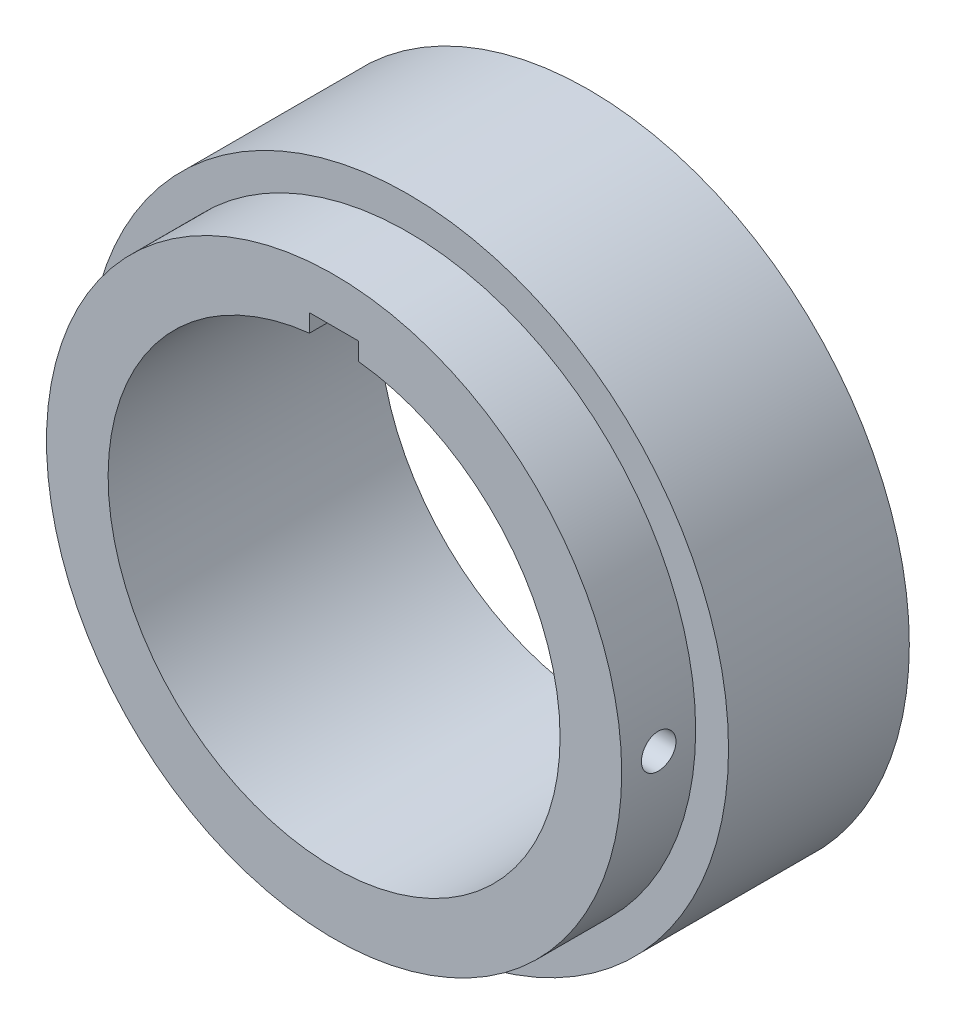
ISO-10303-21;
HEADER;
FILE_DESCRIPTION(('STEP AP214'),'2;1');
FILE_NAME('part.step','',(''),(''),'','','');
FILE_SCHEMA(('AUTOMOTIVE_DESIGN { 1 0 10303 214 1 1 1 1 }'));
ENDSEC;
DATA;
#1=APPLICATION_CONTEXT('core data for automotive mechanical design processes');
#2=APPLICATION_PROTOCOL_DEFINITION('international standard','automotive_design',2000,#1);
#3=PRODUCT_CONTEXT('',#1,'mechanical');
#4=PRODUCT('Part','Part','',(#3));
#5=PRODUCT_RELATED_PRODUCT_CATEGORY('part','',(#4));
#6=PRODUCT_DEFINITION_FORMATION('','',#4);
#7=PRODUCT_DEFINITION_CONTEXT('part definition',#1,'design');
#8=PRODUCT_DEFINITION('design','',#6,#7);
#9=PRODUCT_DEFINITION_SHAPE('','',#8);
#10=(LENGTH_UNIT() NAMED_UNIT(*) SI_UNIT(.MILLI.,.METRE.));
#11=(NAMED_UNIT(*) PLANE_ANGLE_UNIT() SI_UNIT($,.RADIAN.));
#12=(NAMED_UNIT(*) SI_UNIT($,.STERADIAN.) SOLID_ANGLE_UNIT());
#13=UNCERTAINTY_MEASURE_WITH_UNIT(LENGTH_MEASURE(1.E-05),#10,'distance_accuracy_value','');
#14=(GEOMETRIC_REPRESENTATION_CONTEXT(3) GLOBAL_UNCERTAINTY_ASSIGNED_CONTEXT((#13)) GLOBAL_UNIT_ASSIGNED_CONTEXT((#10,
#11,#12)) REPRESENTATION_CONTEXT('',''));
#15=CARTESIAN_POINT('',(0.,0.,0.));
#16=DIRECTION('',(0.,0.,1.));
#17=DIRECTION('',(1.,0.,0.));
#18=AXIS2_PLACEMENT_3D('',#15,#16,#17);
#19=CARTESIAN_POINT('',(0.,0.,0.));
#20=DIRECTION('',(0.,0.,1.));
#21=DIRECTION('',(1.,0.,0.));
#22=AXIS2_PLACEMENT_3D('',#19,#20,#21);
#23=PLANE('',#22);
#24=CARTESIAN_POINT('',(0.,0.,0.));
#25=DIRECTION('',(0.,0.,1.));
#26=DIRECTION('',(1.,0.,0.));
#27=AXIS2_PLACEMENT_3D('',#24,#25,#26);
#28=CIRCLE('',#27,39.);
#29=CARTESIAN_POINT('',(39.,0.,0.));
#30=VERTEX_POINT('',#29);
#31=EDGE_CURVE('E115',#30,#30,#28,.T.);
#32=ORIENTED_EDGE('',*,*,#31,.F.);
#33=EDGE_LOOP('',(#32));
#34=FACE_BOUND('',#33,.T.);
#35=CARTESIAN_POINT('',(0.,0.,0.));
#36=DIRECTION('',(0.,0.,1.));
#37=DIRECTION('',(1.,0.,0.));
#38=AXIS2_PLACEMENT_3D('',#35,#36,#37);
#39=CIRCLE('',#38,37.5);
#40=CARTESIAN_POINT('',(37.5,0.,0.));
#41=VERTEX_POINT('',#40);
#42=EDGE_CURVE('E121',#41,#41,#39,.F.);
#43=ORIENTED_EDGE('',*,*,#42,.F.);
#44=EDGE_LOOP('',(#43));
#45=FACE_BOUND('',#44,.T.);
#46=ADVANCED_FACE('F38',(#34,#45),#23,.F.);
#47=CARTESIAN_POINT('',(0.,0.,22.));
#48=DIRECTION('',(0.,0.,1.));
#49=DIRECTION('',(1.,0.,0.));
#50=AXIS2_PLACEMENT_3D('',#47,#48,#49);
#51=PLANE('',#50);
#52=CARTESIAN_POINT('',(0.,0.,22.));
#53=DIRECTION('',(0.,0.,1.));
#54=DIRECTION('',(1.,0.,0.));
#55=AXIS2_PLACEMENT_3D('',#52,#53,#54);
#56=CIRCLE('',#55,39.);
#57=CARTESIAN_POINT('',(39.,0.,22.));
#58=VERTEX_POINT('',#57);
#59=EDGE_CURVE('E118',#58,#58,#56,.T.);
#60=ORIENTED_EDGE('',*,*,#59,.T.);
#61=EDGE_LOOP('',(#60));
#62=FACE_BOUND('',#61,.T.);
#63=CARTESIAN_POINT('',(0.,0.,22.));
#64=DIRECTION('',(0.,0.,1.));
#65=DIRECTION('',(1.,0.,0.));
#66=AXIS2_PLACEMENT_3D('',#63,#64,#65);
#67=CIRCLE('',#66,35.);
#68=CARTESIAN_POINT('',(35.,0.,22.));
#69=VERTEX_POINT('',#68);
#70=EDGE_CURVE('E109',#69,#69,#67,.T.);
#71=ORIENTED_EDGE('',*,*,#70,.F.);
#72=EDGE_LOOP('',(#71));
#73=FACE_BOUND('',#72,.T.);
#74=ADVANCED_FACE('F149',(#62,#73),#51,.T.);
#75=CARTESIAN_POINT('',(0.,0.,22.));
#76=DIRECTION('',(0.,0.,-1.));
#77=DIRECTION('',(-1.,0.,0.));
#78=AXIS2_PLACEMENT_3D('',#75,#76,#77);
#79=CYLINDRICAL_SURFACE('',#78,39.);
#80=ORIENTED_EDGE('',*,*,#59,.F.);
#81=EDGE_LOOP('',(#80));
#82=FACE_BOUND('',#81,.T.);
#83=ORIENTED_EDGE('',*,*,#31,.T.);
#84=EDGE_LOOP('',(#83));
#85=FACE_BOUND('',#84,.T.);
#86=ADVANCED_FACE('F155',(#82,#85),#79,.T.);
#87=CARTESIAN_POINT('',(0.,0.,31.));
#88=DIRECTION('',(0.,0.,-1.));
#89=DIRECTION('',(-1.,0.,0.));
#90=AXIS2_PLACEMENT_3D('',#87,#88,#89);
#91=CYLINDRICAL_SURFACE('',#90,35.);
#92=CARTESIAN_POINT('',(35.,0.,24.4));
#93=CARTESIAN_POINT('',(34.9999991613155,-0.117844175806978,24.4000051886548));
#94=CARTESIAN_POINT('',(34.9993984651507,-0.235771095805588,24.4099527927887));
#95=CARTESIAN_POINT('',(34.9970599188172,-0.468369368929395,24.4494933481978));
#96=CARTESIAN_POINT('',(34.9953207415902,-0.583036759662994,24.4791092261704));
#97=CARTESIAN_POINT('',(34.990902002106,-0.80571306343822,24.5571332208374));
#98=CARTESIAN_POINT('',(34.9882229323209,-0.913725428713387,24.6055314975936));
#99=CARTESIAN_POINT('',(34.9822258167798,-1.12006459060454,24.7197306672778));
#100=CARTESIAN_POINT('',(34.9789079183873,-1.21839361306148,24.7855275480381));
#101=CARTESIAN_POINT('',(34.9720009937799,-1.40274018967803,24.9327568020215));
#102=CARTESIAN_POINT('',(34.9684116403171,-1.48874251019537,25.0142082355815));
#103=CARTESIAN_POINT('',(34.961369145851,-1.64586419821276,25.1903954090425));
#104=CARTESIAN_POINT('',(34.9579160105162,-1.71698294688472,25.285131701027));
#105=CARTESIAN_POINT('',(34.9515328754156,-1.84236481498864,25.485284589567));
#106=CARTESIAN_POINT('',(34.9486032652102,-1.8966154046809,25.5907090486257));
#107=CARTESIAN_POINT('',(34.9436017471188,-1.98664077162483,25.8091904954062));
#108=CARTESIAN_POINT('',(34.9415298306016,-2.02241573480395,25.9222474063068));
#109=CARTESIAN_POINT('',(34.9384804405188,-2.07443238191165,26.1526388011088));
#110=CARTESIAN_POINT('',(34.9375016397014,-2.09069775599912,26.269967918512));
#111=CARTESIAN_POINT('',(34.9367448835944,-2.103306634241,26.505694891857));
#112=CARTESIAN_POINT('',(34.9369669156032,-2.09965034911297,26.6240927364813));
#113=CARTESIAN_POINT('',(34.9385855541585,-2.07253937054003,26.8584349476114));
#114=CARTESIAN_POINT('',(34.9399806403301,-2.04911030410293,26.9743822908574));
#115=CARTESIAN_POINT('',(34.9437857703825,-1.98315856996509,27.2006954628356));
#116=CARTESIAN_POINT('',(34.9461958199554,-1.94063579518459,27.311061260262));
#117=CARTESIAN_POINT('',(34.951761022144,-1.83767457902033,27.523160842485));
#118=CARTESIAN_POINT('',(34.9549166585015,-1.77722449975263,27.624888964603));
#119=CARTESIAN_POINT('',(34.9616169171288,-1.64013307309805,27.816763594482));
#120=CARTESIAN_POINT('',(34.9651615434173,-1.56349155842882,27.9069099825703));
#121=CARTESIAN_POINT('',(34.9722470659153,-1.39604843547954,28.0732113335103));
#122=CARTESIAN_POINT('',(34.9757879473825,-1.30522464568503,28.1493439649768));
#123=CARTESIAN_POINT('',(34.9824615478539,-1.11207292990968,28.2852844619456));
#124=CARTESIAN_POINT('',(34.9855942667255,-1.00974500019593,28.3450923221507));
#125=CARTESIAN_POINT('',(34.9910987437918,-0.796476279334773,28.4466836060103));
#126=CARTESIAN_POINT('',(34.9934704668885,-0.685535091226617,28.4884661983484));
#127=CARTESIAN_POINT('',(34.9971852047097,-0.458195061217815,28.5528060442005));
#128=CARTESIAN_POINT('',(34.9985282305084,-0.341796278084261,28.5753635046795));
#129=CARTESIAN_POINT('',(35.0000328044319,-0.10703897136977,28.6005851243473));
#130=CARTESIAN_POINT('',(35.0001961864197,0.0113162235317343,28.6032801616056));
#131=CARTESIAN_POINT('',(34.9993279372793,0.246797037935939,28.58878109084));
#132=CARTESIAN_POINT('',(34.9982963118754,0.363922663325893,28.5715870780899));
#133=CARTESIAN_POINT('',(34.9951553764755,0.59353268605767,28.5178235470478));
#134=CARTESIAN_POINT('',(34.9930468536715,0.706020408800857,28.4812681808272));
#135=CARTESIAN_POINT('',(34.9879893773591,0.923264107325084,28.3898339833525));
#136=CARTESIAN_POINT('',(34.9850404168806,1.02802001897363,28.3349550001318));
#137=CARTESIAN_POINT('',(34.9786289361573,1.22696794347034,28.2083526791793));
#138=CARTESIAN_POINT('',(34.9751657885825,1.32114680182054,28.1366087021856));
#139=CARTESIAN_POINT('',(34.9681178358473,1.49613483866214,27.9783430082272));
#140=CARTESIAN_POINT('',(34.9645330295804,1.57694389553163,27.8918211568462));
#141=CARTESIAN_POINT('',(34.9576404999568,1.72300291551882,27.706322616381));
#142=CARTESIAN_POINT('',(34.9543331366402,1.78823285809712,27.6073301481992));
#143=CARTESIAN_POINT('',(34.948374181286,1.90114508952379,27.399779803849));
#144=CARTESIAN_POINT('',(34.945722585462,1.94882747969125,27.2912219829152));
#145=CARTESIAN_POINT('',(34.9413767794724,2.02525635717478,27.0676958453405));
#146=CARTESIAN_POINT('',(34.939681930539,2.05401548065653,26.952731862221));
#147=CARTESIAN_POINT('',(34.9374389708401,2.09182274062151,26.7195965121583));
#148=CARTESIAN_POINT('',(34.936890849757,2.10087105445275,26.6014251740829));
#149=CARTESIAN_POINT('',(34.9370034072185,2.09899815383948,26.3654286752178));
#150=CARTESIAN_POINT('',(34.9376621802684,2.08810841843393,26.247603262403));
#151=CARTESIAN_POINT('',(34.9401102524472,2.04673376244267,26.0154570255148));
#152=CARTESIAN_POINT('',(34.9418995536499,2.01624880591094,25.9011362078707));
#153=CARTESIAN_POINT('',(34.9464065781605,1.93655602438641,25.6792392031706));
#154=CARTESIAN_POINT('',(34.949124298203,1.88734826524505,25.5716629923941));
#155=CARTESIAN_POINT('',(34.9551818318302,1.77161121831211,25.366295422745));
#156=CARTESIAN_POINT('',(34.9585216286548,1.70508239717215,25.2685038003613));
#157=CARTESIAN_POINT('',(34.9654530674257,1.5564759218203,25.0853221004038));
#158=CARTESIAN_POINT('',(34.9690450710395,1.47437563882212,24.9999503948044));
#159=CARTESIAN_POINT('',(34.9760731406369,1.29698473951482,24.8441722861038));
#160=CARTESIAN_POINT('',(34.9795091682073,1.20169089709504,24.7737695539495));
#161=CARTESIAN_POINT('',(34.9858414075535,1.00051681538948,24.6498801801636));
#162=CARTESIAN_POINT('',(34.9887369797973,0.89462425910766,24.596413527872));
#163=CARTESIAN_POINT('',(34.9936532649078,0.6754253444206,24.5080833856066));
#164=CARTESIAN_POINT('',(34.9956750037597,0.562127861290517,24.4731980676695));
#165=CARTESIAN_POINT('',(34.9980849369697,0.373445723595397,24.4321060190323));
#166=CARTESIAN_POINT('',(34.9987999017416,0.299281254628611,24.4200817872381));
#167=CARTESIAN_POINT('',(34.9997577000601,0.150089046436659,24.4040271303077));
#168=CARTESIAN_POINT('',(35.0000005342034,0.0750613083029392,24.399996695066));
#169=CARTESIAN_POINT('',(35.,0.,24.4));
#170=B_SPLINE_CURVE_WITH_KNOTS('',3,(#92,#93,#94,#95,#96,#97,#98,#99,#100,#101,#102,#103,#104,
#105,#106,#107,#108,#109,#110,#111,#112,#113,#114,#115,#116,#117,#118,#119,#120,#121,#122,#123,
#124,#125,#126,#127,#128,#129,#130,#131,#132,#133,#134,#135,#136,#137,#138,#139,#140,#141,#142,
#143,#144,#145,#146,#147,#148,#149,#150,#151,#152,#153,#154,#155,#156,#157,#158,#159,#160,#161,
#162,#163,#164,#165,#166,#167,#168,#169),.UNSPECIFIED.,.T.,.F.,(4,2,2,2,2,2,2,2,2,2,2,2,2,2,2,2,
2,2,2,2,2,2,2,2,2,2,2,2,2,2,2,2,2,2,2,2,2,2,4),(0.,0.353258512707881,0.706929532390121,
1.06041551643278,1.41382005658257,1.76765764507594,2.12150994248214,2.47562445838707,
2.82973541062974,3.18341593530406,3.53709271899714,3.89031181377022,4.24353288946219,
4.59698376980305,4.95043830201183,5.30445128970063,5.65846439226122,6.01249381998192,
6.3665194364077,6.71999456924698,7.07346800885327,7.42668343489931,7.77990179040654,
8.1335546833889,8.48721079329028,8.84131896617821,9.19542509442325,9.54929452479656,
9.90316077121632,10.2564688002887,10.6097774774809,10.9630849120348,11.3163828290183,
11.6701981556022,12.0241001509875,12.3784183071969,12.7323193137709,12.9573289883898,
13.1823383785563),.UNSPECIFIED.);
#171=CARTESIAN_POINT('',(35.,0.,24.4));
#172=VERTEX_POINT('',#171);
#173=EDGE_CURVE('E12',#172,#172,#170,.T.);
#174=ORIENTED_EDGE('',*,*,#173,.T.);
#175=EDGE_LOOP('',(#174));
#176=FACE_BOUND('',#175,.T.);
#177=CARTESIAN_POINT('',(0.,0.,31.));
#178=DIRECTION('',(0.,0.,1.));
#179=DIRECTION('',(1.,0.,0.));
#180=AXIS2_PLACEMENT_3D('',#177,#178,#179);
#181=CIRCLE('',#180,35.);
#182=CARTESIAN_POINT('',(35.,0.,31.));
#183=VERTEX_POINT('',#182);
#184=EDGE_CURVE('E112',#183,#183,#181,.T.);
#185=ORIENTED_EDGE('',*,*,#184,.F.);
#186=EDGE_LOOP('',(#185));
#187=FACE_BOUND('',#186,.T.);
#188=ORIENTED_EDGE('',*,*,#70,.T.);
#189=EDGE_LOOP('',(#188));
#190=FACE_BOUND('',#189,.T.);
#191=ADVANCED_FACE('F161',(#176,#187,#190),#91,.T.);
#192=CARTESIAN_POINT('',(0.,0.,31.));
#193=DIRECTION('',(0.,0.,1.));
#194=DIRECTION('',(1.,0.,0.));
#195=AXIS2_PLACEMENT_3D('',#192,#193,#194);
#196=PLANE('',#195);
#197=DIRECTION('',(0.,-1.,0.));
#198=VECTOR('',#197,1.);
#199=CARTESIAN_POINT('',(-3.,29.5,31.));
#200=LINE('',#199,#198);
#201=CARTESIAN_POINT('',(-3.,29.5,31.));
#202=VERTEX_POINT('',#201);
#203=CARTESIAN_POINT('',(-3.,27.3358738656733,31.));
#204=VERTEX_POINT('',#203);
#205=EDGE_CURVE('E57',#202,#204,#200,.T.);
#206=ORIENTED_EDGE('',*,*,#205,.F.);
#207=DIRECTION('',(-1.,0.,0.));
#208=VECTOR('',#207,1.);
#209=CARTESIAN_POINT('',(-3.,29.5,31.));
#210=LINE('',#209,#208);
#211=CARTESIAN_POINT('',(3.,29.5,31.));
#212=VERTEX_POINT('',#211);
#213=EDGE_CURVE('E102',#212,#202,#210,.T.);
#214=ORIENTED_EDGE('',*,*,#213,.F.);
#215=DIRECTION('',(0.,1.,0.));
#216=VECTOR('',#215,1.);
#217=CARTESIAN_POINT('',(3.,29.5,31.));
#218=LINE('',#217,#216);
#219=CARTESIAN_POINT('',(3.,27.3358738656733,31.));
#220=VERTEX_POINT('',#219);
#221=EDGE_CURVE('E86',#220,#212,#218,.T.);
#222=ORIENTED_EDGE('',*,*,#221,.F.);
#223=CARTESIAN_POINT('',(0.,0.,31.));
#224=DIRECTION('',(0.,0.,1.));
#225=DIRECTION('',(1.,0.,0.));
#226=AXIS2_PLACEMENT_3D('',#223,#224,#225);
#227=CIRCLE('',#226,27.5);
#228=EDGE_CURVE('E95',#204,#220,#227,.T.);
#229=ORIENTED_EDGE('',*,*,#228,.F.);
#230=EDGE_LOOP('',(#206,#214,#222,#229));
#231=FACE_BOUND('',#230,.T.);
#232=ORIENTED_EDGE('',*,*,#184,.T.);
#233=EDGE_LOOP('',(#232));
#234=FACE_BOUND('',#233,.T.);
#235=ADVANCED_FACE('F99',(#231,#234),#196,.T.);
#236=CARTESIAN_POINT('',(0.,0.,-2.));
#237=DIRECTION('',(0.,0.,-1.));
#238=DIRECTION('',(-1.,0.,0.));
#239=AXIS2_PLACEMENT_3D('',#236,#237,#238);
#240=PLANE('',#239);
#241=CARTESIAN_POINT('',(0.,0.,-2.));
#242=DIRECTION('',(0.,0.,-1.));
#243=DIRECTION('',(-1.,0.,0.));
#244=AXIS2_PLACEMENT_3D('',#241,#242,#243);
#245=CIRCLE('',#244,35.5);
#246=CARTESIAN_POINT('',(-35.5,0.,-2.));
#247=VERTEX_POINT('',#246);
#248=EDGE_CURVE('E50',#247,#247,#245,.T.);
#249=ORIENTED_EDGE('',*,*,#248,.T.);
#250=EDGE_LOOP('',(#249));
#251=FACE_BOUND('',#250,.T.);
#252=DIRECTION('',(0.,1.,0.));
#253=VECTOR('',#252,1.);
#254=CARTESIAN_POINT('',(-2.99999999999999,0.,-2.));
#255=LINE('',#254,#253);
#256=CARTESIAN_POINT('',(-3.,27.3358738656733,-2.));
#257=VERTEX_POINT('',#256);
#258=CARTESIAN_POINT('',(-3.,29.5,-2.));
#259=VERTEX_POINT('',#258);
#260=EDGE_CURVE('E131',#257,#259,#255,.T.);
#261=ORIENTED_EDGE('',*,*,#260,.F.);
#262=CARTESIAN_POINT('',(0.,0.,-2.));
#263=DIRECTION('',(0.,0.,-1.));
#264=DIRECTION('',(-1.,0.,0.));
#265=AXIS2_PLACEMENT_3D('',#262,#263,#264);
#266=CIRCLE('',#265,27.5);
#267=CARTESIAN_POINT('',(3.,27.3358738656733,-2.));
#268=VERTEX_POINT('',#267);
#269=EDGE_CURVE('E126',#268,#257,#266,.T.);
#270=ORIENTED_EDGE('',*,*,#269,.F.);
#271=DIRECTION('',(0.,-1.,0.));
#272=VECTOR('',#271,1.);
#273=CARTESIAN_POINT('',(3.00000000000001,0.,-2.));
#274=LINE('',#273,#272);
#275=CARTESIAN_POINT('',(3.,29.5,-2.));
#276=VERTEX_POINT('',#275);
#277=EDGE_CURVE('E89',#276,#268,#274,.T.);
#278=ORIENTED_EDGE('',*,*,#277,.F.);
#279=DIRECTION('',(1.,0.,0.));
#280=VECTOR('',#279,1.);
#281=CARTESIAN_POINT('',(0.,29.5,-2.));
#282=LINE('',#281,#280);
#283=EDGE_CURVE('E129',#259,#276,#282,.T.);
#284=ORIENTED_EDGE('',*,*,#283,.F.);
#285=EDGE_LOOP('',(#261,#270,#278,#284));
#286=FACE_BOUND('',#285,.T.);
#287=ADVANCED_FACE('F135',(#251,#286),#240,.T.);
#288=CARTESIAN_POINT('',(-3.,29.5,-82.));
#289=DIRECTION('',(-1.,0.,0.));
#290=DIRECTION('',(0.,-1.,0.));
#291=AXIS2_PLACEMENT_3D('',#288,#289,#290);
#292=PLANE('',#291);
#293=ORIENTED_EDGE('',*,*,#260,.T.);
#294=DIRECTION('',(0.,0.,1.));
#295=VECTOR('',#294,1.);
#296=CARTESIAN_POINT('',(-3.,29.5,-82.));
#297=LINE('',#296,#295);
#298=EDGE_CURVE('E107',#259,#202,#297,.T.);
#299=ORIENTED_EDGE('',*,*,#298,.T.);
#300=ORIENTED_EDGE('',*,*,#205,.T.);
#301=DIRECTION('',(0.,0.,1.));
#302=VECTOR('',#301,1.);
#303=CARTESIAN_POINT('',(-3.,27.3358738656733,-82.));
#304=LINE('',#303,#302);
#305=EDGE_CURVE('E92',#257,#204,#304,.T.);
#306=ORIENTED_EDGE('',*,*,#305,.F.);
#307=EDGE_LOOP('',(#293,#299,#300,#306));
#308=FACE_BOUND('',#307,.T.);
#309=ADVANCED_FACE('F181',(#308),#292,.F.);
#310=CARTESIAN_POINT('',(-3.,29.5,-82.));
#311=DIRECTION('',(0.,1.,0.));
#312=DIRECTION('',(0.,0.,1.));
#313=AXIS2_PLACEMENT_3D('',#310,#311,#312);
#314=PLANE('',#313);
#315=ORIENTED_EDGE('',*,*,#283,.T.);
#316=DIRECTION('',(0.,0.,1.));
#317=VECTOR('',#316,1.);
#318=CARTESIAN_POINT('',(3.,29.5,-82.));
#319=LINE('',#318,#317);
#320=EDGE_CURVE('E91',#276,#212,#319,.T.);
#321=ORIENTED_EDGE('',*,*,#320,.T.);
#322=ORIENTED_EDGE('',*,*,#213,.T.);
#323=ORIENTED_EDGE('',*,*,#298,.F.);
#324=EDGE_LOOP('',(#315,#321,#322,#323));
#325=FACE_BOUND('',#324,.T.);
#326=ADVANCED_FACE('F183',(#325),#314,.F.);
#327=CARTESIAN_POINT('',(3.,29.5,-82.));
#328=DIRECTION('',(1.,0.,0.));
#329=DIRECTION('',(0.,1.,0.));
#330=AXIS2_PLACEMENT_3D('',#327,#328,#329);
#331=PLANE('',#330);
#332=ORIENTED_EDGE('',*,*,#277,.T.);
#333=DIRECTION('',(0.,0.,1.));
#334=VECTOR('',#333,1.);
#335=CARTESIAN_POINT('',(3.,27.3358738656733,-82.));
#336=LINE('',#335,#334);
#337=EDGE_CURVE('E65',#268,#220,#336,.T.);
#338=ORIENTED_EDGE('',*,*,#337,.T.);
#339=ORIENTED_EDGE('',*,*,#221,.T.);
#340=ORIENTED_EDGE('',*,*,#320,.F.);
#341=EDGE_LOOP('',(#332,#338,#339,#340));
#342=FACE_BOUND('',#341,.T.);
#343=ADVANCED_FACE('F83',(#342),#331,.F.);
#344=CARTESIAN_POINT('',(0.,0.,-82.));
#345=DIRECTION('',(0.,0.,1.));
#346=DIRECTION('',(1.,0.,0.));
#347=AXIS2_PLACEMENT_3D('',#344,#345,#346);
#348=CYLINDRICAL_SURFACE('',#347,27.5);
#349=CARTESIAN_POINT('',(27.5,0.,24.4));
#350=CARTESIAN_POINT('',(27.4999989437565,0.117773831579415,24.4000051586405));
#351=CARTESIAN_POINT('',(27.4992353427511,0.235628677910628,24.4099409394692));
#352=CARTESIAN_POINT('',(27.4962626023428,0.468079969882942,24.4494317903303));
#353=CARTESIAN_POINT('',(27.494051808875,0.582672530328934,24.4790093103988));
#354=CARTESIAN_POINT('',(27.4884346128029,0.805198822320202,24.5569254632112));
#355=CARTESIAN_POINT('',(27.4850288700669,0.913136190360176,24.6052537430702));
#356=CARTESIAN_POINT('',(27.4774041190497,1.11934010972849,24.7192816483233));
#357=CARTESIAN_POINT('',(27.4731852892743,1.21760877659424,24.7849774620046));
#358=CARTESIAN_POINT('',(27.4643978563486,1.40192519088114,24.9320297202929));
#359=CARTESIAN_POINT('',(27.4598285984407,1.48794915927903,25.0134159331552));
#360=CARTESIAN_POINT('',(27.4508608186825,1.64513043650983,25.1894762307927));
#361=CARTESIAN_POINT('',(27.4464623042021,1.71628710419712,25.2841508883318));
#362=CARTESIAN_POINT('',(27.4383267569824,1.84179239915025,25.4842420074875));
#363=CARTESIAN_POINT('',(27.4345905364731,1.89612044815588,25.5896714124815));
#364=CARTESIAN_POINT('',(27.4282097168102,1.9862948290655,25.8081888884871));
#365=CARTESIAN_POINT('',(27.42556510115,2.02214144043849,25.9212768436599));
#366=CARTESIAN_POINT('',(27.4216721665286,2.07426723997372,26.1516654573911));
#367=CARTESIAN_POINT('',(27.4204211118585,2.09058477051185,26.2689573939451));
#368=CARTESIAN_POINT('',(27.4194482034513,2.10330763446875,26.5046215481596));
#369=CARTESIAN_POINT('',(27.4197263251899,2.09971328722846,26.6229937484647));
#370=CARTESIAN_POINT('',(27.4217778684734,2.07274615483877,26.857196072526));
#371=CARTESIAN_POINT('',(27.4235481446977,2.04941497269972,26.9730310180384));
#372=CARTESIAN_POINT('',(27.4283795801706,1.98370105413401,27.1991358276377));
#373=CARTESIAN_POINT('',(27.4314407502499,1.94131815786224,27.3094056450243));
#374=CARTESIAN_POINT('',(27.4385126589516,1.8386570863827,27.5213830288985));
#375=CARTESIAN_POINT('',(27.4425243911338,1.77836016997629,27.6230814844957));
#376=CARTESIAN_POINT('',(27.4510444348124,1.64159619866183,27.8149296796766));
#377=CARTESIAN_POINT('',(27.4555527547284,1.56512886956315,27.9050792233916));
#378=CARTESIAN_POINT('',(27.4645719571218,1.39796100332552,28.0715125347742));
#379=CARTESIAN_POINT('',(27.4690828165479,1.30722448603637,28.1477601694219));
#380=CARTESIAN_POINT('',(27.4775877671024,1.11421966536706,28.2839461440079));
#381=CARTESIAN_POINT('',(27.4815818579536,1.01195135580377,28.3438844752013));
#382=CARTESIAN_POINT('',(27.4886038185635,0.798763057647645,28.4457478701539));
#383=CARTESIAN_POINT('',(27.4916316070285,0.687842342117902,28.4876714184607));
#384=CARTESIAN_POINT('',(27.4963788212179,0.460508277278564,28.5522903208322));
#385=CARTESIAN_POINT('',(27.4980982697421,0.344095023722391,28.5749860099726));
#386=CARTESIAN_POINT('',(27.500032135307,0.109393732211143,28.6004598387561));
#387=CARTESIAN_POINT('',(27.5002503249364,-0.00888885709908791,28.60328790512));
#388=CARTESIAN_POINT('',(27.4991671488793,-0.244246563162206,28.5890768761236));
#389=CARTESIAN_POINT('',(27.4978657950649,-0.361321689341763,28.5720379359839));
#390=CARTESIAN_POINT('',(27.4938923639233,-0.590799407468367,28.5186179326709));
#391=CARTESIAN_POINT('',(27.4912219206249,-0.703207397219628,28.4822599252159));
#392=CARTESIAN_POINT('',(27.4848104583339,-0.920326979083385,28.3912573561415));
#393=CARTESIAN_POINT('',(27.4810694250581,-1.02503846849096,28.3366125505504));
#394=CARTESIAN_POINT('',(27.4729271017341,-1.22402040819211,28.2104614863957));
#395=CARTESIAN_POINT('',(27.4685245189275,-1.31826977276287,28.138922053388));
#396=CARTESIAN_POINT('',(27.4595583834834,-1.49343943603957,27.9810605307214));
#397=CARTESIAN_POINT('',(27.4549948284969,-1.57435954013373,27.894738225265));
#398=CARTESIAN_POINT('',(27.4462100019418,-1.72074413912045,27.7095451313501));
#399=CARTESIAN_POINT('',(27.4419894623689,-1.7861761230382,27.6106486053117));
#400=CARTESIAN_POINT('',(27.4343784855594,-1.89950439206921,27.4032429360984));
#401=CARTESIAN_POINT('',(27.4309880411821,-1.94740082803048,27.2947338756244));
#402=CARTESIAN_POINT('',(27.4254249644515,-2.02424267743586,27.0712997556242));
#403=CARTESIAN_POINT('',(27.4232510403939,-2.05320819728415,26.956381644414));
#404=CARTESIAN_POINT('',(27.4203626404023,-2.09143152837373,26.7232958853856));
#405=CARTESIAN_POINT('',(27.4196481414264,-2.10068965076191,26.6051282889012));
#406=CARTESIAN_POINT('',(27.4197597498991,-2.09923203092214,26.369221028014));
#407=CARTESIAN_POINT('',(27.4205819167003,-2.08856737897201,26.2514810426871));
#408=CARTESIAN_POINT('',(27.4236658531753,-2.04767325430505,26.0194692857348));
#409=CARTESIAN_POINT('',(27.4259276252147,-2.01744374943741,25.905197519809));
#410=CARTESIAN_POINT('',(27.4316349039118,-1.938290488827,25.6833611472931));
#411=CARTESIAN_POINT('',(27.4350803672164,-1.8893674177331,25.5757962952311));
#412=CARTESIAN_POINT('',(27.4427668383194,-1.77422182081867,25.3703989693654));
#413=CARTESIAN_POINT('',(27.4470078306711,-1.70799963088066,25.2725663066508));
#414=CARTESIAN_POINT('',(27.4558203595162,-1.55994416852834,25.0891495144171));
#415=CARTESIAN_POINT('',(27.4603926757779,-1.47807327384434,25.0035957917545));
#416=CARTESIAN_POINT('',(27.469345619524,-1.30110840458891,24.8474124333963));
#417=CARTESIAN_POINT('',(27.4737262001726,-1.20601122263008,24.7767864281856));
#418=CARTESIAN_POINT('',(27.4818087343157,-1.0051378153805,24.6523845382076));
#419=CARTESIAN_POINT('',(27.4855095704542,-0.899344442571165,24.598636295815));
#420=CARTESIAN_POINT('',(27.4918019798647,-0.680280455048828,24.5097335526436));
#421=CARTESIAN_POINT('',(27.4943948363815,-0.567018666674508,24.4745575306186));
#422=CARTESIAN_POINT('',(27.497508425223,-0.377566202100983,24.4328239624675));
#423=CARTESIAN_POINT('',(27.4984385494485,-0.302596311756288,24.4205311733167));
#424=CARTESIAN_POINT('',(27.499684676513,-0.151762161457568,24.4041175387293));
#425=CARTESIAN_POINT('',(27.5000006806832,-0.0758979034427282,24.3999966755773));
#426=CARTESIAN_POINT('',(27.5,0.,24.4));
#427=B_SPLINE_CURVE_WITH_KNOTS('',3,(#349,#350,#351,#352,#353,#354,#355,#356,#357,#358,#359,
#360,#361,#362,#363,#364,#365,#366,#367,#368,#369,#370,#371,#372,#373,#374,#375,#376,#377,#378,
#379,#380,#381,#382,#383,#384,#385,#386,#387,#388,#389,#390,#391,#392,#393,#394,#395,#396,#397,
#398,#399,#400,#401,#402,#403,#404,#405,#406,#407,#408,#409,#410,#411,#412,#413,#414,#415,#416,
#417,#418,#419,#420,#421,#422,#423,#424,#425,#426),.UNSPECIFIED.,.T.,.F.,(4,2,2,2,2,2,2,2,2,2,2,
2,2,2,2,2,2,2,2,2,2,2,2,2,2,2,2,2,2,2,2,2,2,2,2,2,2,2,4),(0.,0.353044398524774,
0.706493014441518,1.05974675732898,1.41292303467034,1.76677608163646,2.12064438520721,
2.47494371088158,2.82923767882441,3.18283489737965,3.53642644506133,3.8892745137116,
4.2421255428354,4.59534702358724,4.94857449415466,5.30270735689628,5.65684040951853,
6.01100324694634,6.36515991240378,6.71842627374259,7.07168987503838,7.42453282905097,
7.77738049067452,8.13092685419374,8.48447837915348,8.83876558713559,9.19304974732171,
9.54695701044345,9.90085868591903,10.2538540559325,10.606850006023,10.9598330289327,
11.3128091987757,11.6666449101541,12.0205665771297,12.3750649091569,12.7291515465336,
12.9566671788137,13.1841823178806),.UNSPECIFIED.);
#428=CARTESIAN_POINT('',(27.5,0.,24.4));
#429=VERTEX_POINT('',#428);
#430=EDGE_CURVE('E188',#429,#429,#427,.T.);
#431=ORIENTED_EDGE('',*,*,#430,.T.);
#432=EDGE_LOOP('',(#431));
#433=FACE_BOUND('',#432,.T.);
#434=ORIENTED_EDGE('',*,*,#269,.T.);
#435=ORIENTED_EDGE('',*,*,#305,.T.);
#436=ORIENTED_EDGE('',*,*,#228,.T.);
#437=ORIENTED_EDGE('',*,*,#337,.F.);
#438=EDGE_LOOP('',(#434,#435,#436,#437));
#439=FACE_BOUND('',#438,.T.);
#440=ADVANCED_FACE('F96',(#433,#439),#348,.F.);
#441=CARTESIAN_POINT('',(0.,0.,-2.));
#442=DIRECTION('',(0.,0.,1.));
#443=DIRECTION('',(1.,0.,0.));
#444=AXIS2_PLACEMENT_3D('',#441,#442,#443);
#445=CONICAL_SURFACE('',#444,35.5,0.785398163397448);
#446=ORIENTED_EDGE('',*,*,#42,.T.);
#447=EDGE_LOOP('',(#446));
#448=FACE_BOUND('',#447,.T.);
#449=ORIENTED_EDGE('',*,*,#248,.F.);
#450=EDGE_LOOP('',(#449));
#451=FACE_BOUND('',#450,.T.);
#452=ADVANCED_FACE('F40',(#448,#451),#445,.T.);
#453=CARTESIAN_POINT('',(35.,0.,26.5));
#454=DIRECTION('',(1.,0.,0.));
#455=DIRECTION('',(0.,0.,-1.));
#456=AXIS2_PLACEMENT_3D('',#453,#454,#455);
#457=CYLINDRICAL_SURFACE('',#456,2.09999999999999);
#458=ORIENTED_EDGE('',*,*,#173,.F.);
#459=EDGE_LOOP('',(#458));
#460=FACE_BOUND('',#459,.T.);
#461=ORIENTED_EDGE('',*,*,#430,.F.);
#462=EDGE_LOOP('',(#461));
#463=FACE_BOUND('',#462,.T.);
#464=ADVANCED_FACE('F139',(#460,#463),#457,.F.);
#465=CLOSED_SHELL('',(#46,#74,#86,#191,#235,#287,#309,#326,#343,#440,#452,#464));
#466=MANIFOLD_SOLID_BREP('B2',#465);
#467=ADVANCED_BREP_SHAPE_REPRESENTATION('',(#18,#466),#14);
#468=SHAPE_DEFINITION_REPRESENTATION(#9,#467);
ENDSEC;
END-ISO-10303-21;
